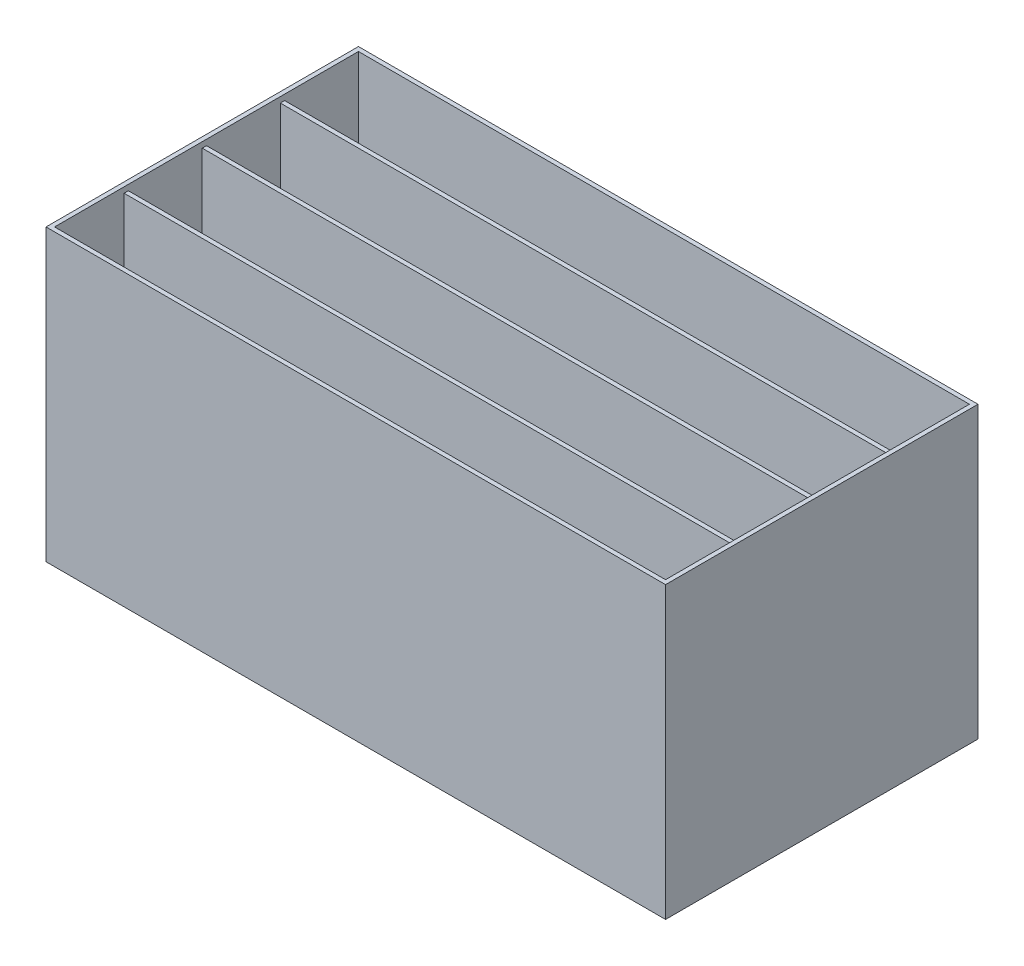
ISO-10303-21;
HEADER;
FILE_DESCRIPTION(('STEP AP214'),'2;1');
FILE_NAME('part.step','',(''),(''),'','','');
FILE_SCHEMA(('AUTOMOTIVE_DESIGN { 1 0 10303 214 1 1 1 1 }'));
ENDSEC;
DATA;
#1=APPLICATION_CONTEXT('core data for automotive mechanical design processes');
#2=APPLICATION_PROTOCOL_DEFINITION('international standard','automotive_design',2000,#1);
#3=PRODUCT_CONTEXT('',#1,'mechanical');
#4=PRODUCT('Part','Part','',(#3));
#5=PRODUCT_RELATED_PRODUCT_CATEGORY('part','',(#4));
#6=PRODUCT_DEFINITION_FORMATION('','',#4);
#7=PRODUCT_DEFINITION_CONTEXT('part definition',#1,'design');
#8=PRODUCT_DEFINITION('design','',#6,#7);
#9=PRODUCT_DEFINITION_SHAPE('','',#8);
#10=(LENGTH_UNIT() NAMED_UNIT(*) SI_UNIT(.MILLI.,.METRE.));
#11=(NAMED_UNIT(*) PLANE_ANGLE_UNIT() SI_UNIT($,.RADIAN.));
#12=(NAMED_UNIT(*) SI_UNIT($,.STERADIAN.) SOLID_ANGLE_UNIT());
#13=UNCERTAINTY_MEASURE_WITH_UNIT(LENGTH_MEASURE(1.E-05),#10,'distance_accuracy_value','');
#14=(GEOMETRIC_REPRESENTATION_CONTEXT(3) GLOBAL_UNCERTAINTY_ASSIGNED_CONTEXT((#13)) GLOBAL_UNIT_ASSIGNED_CONTEXT((#10,
#11,#12)) REPRESENTATION_CONTEXT('',''));
#15=CARTESIAN_POINT('',(0.,0.,0.));
#16=DIRECTION('',(0.,0.,1.));
#17=DIRECTION('',(1.,0.,0.));
#18=AXIS2_PLACEMENT_3D('',#15,#16,#17);
#19=CARTESIAN_POINT('',(6.35,430.2125,0.));
#20=DIRECTION('',(1.,0.,0.));
#21=DIRECTION('',(0.,0.,-1.));
#22=AXIS2_PLACEMENT_3D('',#19,#20,#21);
#23=PLANE('',#22);
#24=DIRECTION('',(0.,0.,1.));
#25=VECTOR('',#24,1.);
#26=CARTESIAN_POINT('',(6.35,421.894,-115.8875));
#27=LINE('',#26,#25);
#28=CARTESIAN_POINT('',(6.35,421.894,-115.8875));
#29=VERTEX_POINT('',#28);
#30=CARTESIAN_POINT('',(6.35,421.894,-109.5375));
#31=VERTEX_POINT('',#30);
#32=EDGE_CURVE('E53',#29,#31,#27,.T.);
#33=ORIENTED_EDGE('',*,*,#32,.F.);
#34=DIRECTION('',(0.,-1.,0.));
#35=VECTOR('',#34,1.);
#36=CARTESIAN_POINT('',(6.35,421.894,-115.8875));
#37=LINE('',#36,#35);
#38=CARTESIAN_POINT('',(6.35,6.35,-115.8875));
#39=VERTEX_POINT('',#38);
#40=EDGE_CURVE('E647',#29,#39,#37,.T.);
#41=ORIENTED_EDGE('',*,*,#40,.T.);
#42=DIRECTION('',(0.,0.,1.));
#43=VECTOR('',#42,1.);
#44=CARTESIAN_POINT('',(6.35,6.35,0.));
#45=LINE('',#44,#43);
#46=CARTESIAN_POINT('',(6.35,6.35,-225.425));
#47=VERTEX_POINT('',#46);
#48=EDGE_CURVE('E635',#47,#39,#45,.T.);
#49=ORIENTED_EDGE('',*,*,#48,.F.);
#50=DIRECTION('',(0.,-1.,0.));
#51=VECTOR('',#50,1.);
#52=CARTESIAN_POINT('',(6.35,421.894,-225.425));
#53=LINE('',#52,#51);
#54=CARTESIAN_POINT('',(6.35,421.894,-225.425));
#55=VERTEX_POINT('',#54);
#56=EDGE_CURVE('E202',#55,#47,#53,.T.);
#57=ORIENTED_EDGE('',*,*,#56,.F.);
#58=DIRECTION('',(0.,0.,1.));
#59=VECTOR('',#58,1.);
#60=CARTESIAN_POINT('',(6.35,421.894,-231.775));
#61=LINE('',#60,#59);
#62=CARTESIAN_POINT('',(6.35,421.894,-231.775));
#63=VERTEX_POINT('',#62);
#64=EDGE_CURVE('E223',#63,#55,#61,.T.);
#65=ORIENTED_EDGE('',*,*,#64,.F.);
#66=DIRECTION('',(0.,-1.,0.));
#67=VECTOR('',#66,1.);
#68=CARTESIAN_POINT('',(6.35,421.894,-231.775));
#69=LINE('',#68,#67);
#70=CARTESIAN_POINT('',(6.35,6.35,-231.775));
#71=VERTEX_POINT('',#70);
#72=EDGE_CURVE('E199',#63,#71,#69,.T.);
#73=ORIENTED_EDGE('',*,*,#72,.T.);
#74=CARTESIAN_POINT('',(6.35,6.35,-341.3125));
#75=VERTEX_POINT('',#74);
#76=EDGE_CURVE('E268',#75,#71,#45,.T.);
#77=ORIENTED_EDGE('',*,*,#76,.F.);
#78=DIRECTION('',(0.,-1.,0.));
#79=VECTOR('',#78,1.);
#80=CARTESIAN_POINT('',(6.35,421.894,-341.3125));
#81=LINE('',#80,#79);
#82=CARTESIAN_POINT('',(6.35,421.894,-341.3125));
#83=VERTEX_POINT('',#82);
#84=EDGE_CURVE('E262',#83,#75,#81,.T.);
#85=ORIENTED_EDGE('',*,*,#84,.F.);
#86=DIRECTION('',(0.,0.,1.));
#87=VECTOR('',#86,1.);
#88=CARTESIAN_POINT('',(6.35,421.894,-347.6625));
#89=LINE('',#88,#87);
#90=CARTESIAN_POINT('',(6.35,421.894,-347.6625));
#91=VERTEX_POINT('',#90);
#92=EDGE_CURVE('E241',#91,#83,#89,.T.);
#93=ORIENTED_EDGE('',*,*,#92,.F.);
#94=DIRECTION('',(0.,-1.,0.));
#95=VECTOR('',#94,1.);
#96=CARTESIAN_POINT('',(6.35,421.894,-347.6625));
#97=LINE('',#96,#95);
#98=CARTESIAN_POINT('',(6.35,6.35,-347.6625));
#99=VERTEX_POINT('',#98);
#100=EDGE_CURVE('E253',#91,#99,#97,.T.);
#101=ORIENTED_EDGE('',*,*,#100,.T.);
#102=CARTESIAN_POINT('',(6.35,6.35,-457.2));
#103=VERTEX_POINT('',#102);
#104=EDGE_CURVE('E266',#103,#99,#45,.T.);
#105=ORIENTED_EDGE('',*,*,#104,.F.);
#106=DIRECTION('',(0.,-1.,0.));
#107=VECTOR('',#106,1.);
#108=CARTESIAN_POINT('',(6.35,430.2125,-457.2));
#109=LINE('',#108,#107);
#110=CARTESIAN_POINT('',(6.35,430.2125,-457.2));
#111=VERTEX_POINT('',#110);
#112=EDGE_CURVE('E274',#111,#103,#109,.T.);
#113=ORIENTED_EDGE('',*,*,#112,.F.);
#114=DIRECTION('',(0.,0.,1.));
#115=VECTOR('',#114,1.);
#116=CARTESIAN_POINT('',(6.35,430.2125,0.));
#117=LINE('',#116,#115);
#118=CARTESIAN_POINT('',(6.35,430.2125,-6.35));
#119=VERTEX_POINT('',#118);
#120=EDGE_CURVE('E284',#111,#119,#117,.T.);
#121=ORIENTED_EDGE('',*,*,#120,.T.);
#122=DIRECTION('',(0.,-1.,0.));
#123=VECTOR('',#122,1.);
#124=CARTESIAN_POINT('',(6.35,430.2125,-6.35));
#125=LINE('',#124,#123);
#126=CARTESIAN_POINT('',(6.35,6.35,-6.35));
#127=VERTEX_POINT('',#126);
#128=EDGE_CURVE('E269',#119,#127,#125,.T.);
#129=ORIENTED_EDGE('',*,*,#128,.T.);
#130=CARTESIAN_POINT('',(6.35,6.35,-109.5375));
#131=VERTEX_POINT('',#130);
#132=EDGE_CURVE('E265',#131,#127,#45,.T.);
#133=ORIENTED_EDGE('',*,*,#132,.F.);
#134=DIRECTION('',(0.,-1.,0.));
#135=VECTOR('',#134,1.);
#136=CARTESIAN_POINT('',(6.35,421.894,-109.5375));
#137=LINE('',#136,#135);
#138=EDGE_CURVE('E58',#31,#131,#137,.T.);
#139=ORIENTED_EDGE('',*,*,#138,.F.);
#140=EDGE_LOOP('',(#33,#41,#49,#57,#65,#73,#77,#85,#93,#101,#105,#113,#121,#129,#133,#139));
#141=FACE_BOUND('',#140,.T.);
#142=ADVANCED_FACE('F38',(#141),#23,.T.);
#143=CARTESIAN_POINT('',(912.8125,430.2125,0.));
#144=DIRECTION('',(-1.,0.,0.));
#145=DIRECTION('',(0.,0.,1.));
#146=AXIS2_PLACEMENT_3D('',#143,#144,#145);
#147=PLANE('',#146);
#148=DIRECTION('',(0.,0.,-1.));
#149=VECTOR('',#148,1.);
#150=CARTESIAN_POINT('',(912.8125,6.35,0.));
#151=LINE('',#150,#149);
#152=CARTESIAN_POINT('',(912.8125,6.35,-115.8875));
#153=VERTEX_POINT('',#152);
#154=CARTESIAN_POINT('',(912.8125,6.35,-225.425));
#155=VERTEX_POINT('',#154);
#156=EDGE_CURVE('E184',#153,#155,#151,.T.);
#157=ORIENTED_EDGE('',*,*,#156,.F.);
#158=DIRECTION('',(0.,-1.,0.));
#159=VECTOR('',#158,1.);
#160=CARTESIAN_POINT('',(912.8125,421.894,-115.8875));
#161=LINE('',#160,#159);
#162=CARTESIAN_POINT('',(912.8125,421.894,-115.8875));
#163=VERTEX_POINT('',#162);
#164=EDGE_CURVE('E196',#163,#153,#161,.T.);
#165=ORIENTED_EDGE('',*,*,#164,.F.);
#166=DIRECTION('',(0.,0.,-1.));
#167=VECTOR('',#166,1.);
#168=CARTESIAN_POINT('',(912.8125,421.894,-115.8875));
#169=LINE('',#168,#167);
#170=CARTESIAN_POINT('',(912.8125,421.894,-109.5375));
#171=VERTEX_POINT('',#170);
#172=EDGE_CURVE('E192',#171,#163,#169,.T.);
#173=ORIENTED_EDGE('',*,*,#172,.F.);
#174=DIRECTION('',(0.,-1.,0.));
#175=VECTOR('',#174,1.);
#176=CARTESIAN_POINT('',(912.8125,421.894,-109.5375));
#177=LINE('',#176,#175);
#178=CARTESIAN_POINT('',(912.8125,6.35,-109.5375));
#179=VERTEX_POINT('',#178);
#180=EDGE_CURVE('E188',#171,#179,#177,.T.);
#181=ORIENTED_EDGE('',*,*,#180,.T.);
#182=CARTESIAN_POINT('',(912.8125,6.35,-6.35));
#183=VERTEX_POINT('',#182);
#184=EDGE_CURVE('E173',#183,#179,#151,.T.);
#185=ORIENTED_EDGE('',*,*,#184,.F.);
#186=DIRECTION('',(0.,-1.,0.));
#187=VECTOR('',#186,1.);
#188=CARTESIAN_POINT('',(912.8125,430.2125,-6.35));
#189=LINE('',#188,#187);
#190=CARTESIAN_POINT('',(912.8125,430.2125,-6.35));
#191=VERTEX_POINT('',#190);
#192=EDGE_CURVE('E273',#191,#183,#189,.T.);
#193=ORIENTED_EDGE('',*,*,#192,.F.);
#194=DIRECTION('',(0.,0.,-1.));
#195=VECTOR('',#194,1.);
#196=CARTESIAN_POINT('',(912.8125,430.2125,0.));
#197=LINE('',#196,#195);
#198=CARTESIAN_POINT('',(912.8125,430.2125,-457.2));
#199=VERTEX_POINT('',#198);
#200=EDGE_CURVE('E288',#191,#199,#197,.T.);
#201=ORIENTED_EDGE('',*,*,#200,.T.);
#202=DIRECTION('',(0.,-1.,0.));
#203=VECTOR('',#202,1.);
#204=CARTESIAN_POINT('',(912.8125,430.2125,-457.2));
#205=LINE('',#204,#203);
#206=CARTESIAN_POINT('',(912.8125,6.35,-457.2));
#207=VERTEX_POINT('',#206);
#208=EDGE_CURVE('E277',#199,#207,#205,.T.);
#209=ORIENTED_EDGE('',*,*,#208,.T.);
#210=CARTESIAN_POINT('',(912.8125,6.35,-347.6625));
#211=VERTEX_POINT('',#210);
#212=EDGE_CURVE('E186',#211,#207,#151,.T.);
#213=ORIENTED_EDGE('',*,*,#212,.F.);
#214=DIRECTION('',(0.,-1.,0.));
#215=VECTOR('',#214,1.);
#216=CARTESIAN_POINT('',(912.8125,421.894,-347.6625));
#217=LINE('',#216,#215);
#218=CARTESIAN_POINT('',(912.8125,421.894,-347.6625));
#219=VERTEX_POINT('',#218);
#220=EDGE_CURVE('E256',#219,#211,#217,.T.);
#221=ORIENTED_EDGE('',*,*,#220,.F.);
#222=DIRECTION('',(0.,0.,-1.));
#223=VECTOR('',#222,1.);
#224=CARTESIAN_POINT('',(912.8125,421.894,-347.6625));
#225=LINE('',#224,#223);
#226=CARTESIAN_POINT('',(912.8125,421.894,-341.3125));
#227=VERTEX_POINT('',#226);
#228=EDGE_CURVE('E247',#227,#219,#225,.T.);
#229=ORIENTED_EDGE('',*,*,#228,.F.);
#230=DIRECTION('',(0.,-1.,0.));
#231=VECTOR('',#230,1.);
#232=CARTESIAN_POINT('',(912.8125,421.894,-341.3125));
#233=LINE('',#232,#231);
#234=CARTESIAN_POINT('',(912.8125,6.35,-341.3125));
#235=VERTEX_POINT('',#234);
#236=EDGE_CURVE('E259',#227,#235,#233,.T.);
#237=ORIENTED_EDGE('',*,*,#236,.T.);
#238=CARTESIAN_POINT('',(912.8125,6.35,-231.775));
#239=VERTEX_POINT('',#238);
#240=EDGE_CURVE('E639',#239,#235,#151,.T.);
#241=ORIENTED_EDGE('',*,*,#240,.F.);
#242=DIRECTION('',(0.,-1.,0.));
#243=VECTOR('',#242,1.);
#244=CARTESIAN_POINT('',(912.8125,421.894,-231.775));
#245=LINE('',#244,#243);
#246=CARTESIAN_POINT('',(912.8125,421.894,-231.775));
#247=VERTEX_POINT('',#246);
#248=EDGE_CURVE('E214',#247,#239,#245,.T.);
#249=ORIENTED_EDGE('',*,*,#248,.F.);
#250=DIRECTION('',(0.,0.,-1.));
#251=VECTOR('',#250,1.);
#252=CARTESIAN_POINT('',(912.8125,421.894,-231.775));
#253=LINE('',#252,#251);
#254=CARTESIAN_POINT('',(912.8125,421.894,-225.425));
#255=VERTEX_POINT('',#254);
#256=EDGE_CURVE('E217',#255,#247,#253,.T.);
#257=ORIENTED_EDGE('',*,*,#256,.F.);
#258=DIRECTION('',(0.,-1.,0.));
#259=VECTOR('',#258,1.);
#260=CARTESIAN_POINT('',(912.8125,421.894,-225.425));
#261=LINE('',#260,#259);
#262=EDGE_CURVE('E211',#255,#155,#261,.T.);
#263=ORIENTED_EDGE('',*,*,#262,.T.);
#264=EDGE_LOOP('',(#157,#165,#173,#181,#185,#193,#201,#209,#213,#221,#229,#237,#241,#249,#257,#263));
#265=FACE_BOUND('',#264,.T.);
#266=ADVANCED_FACE('F190',(#265),#147,.T.);
#267=CARTESIAN_POINT('',(0.,6.35,0.));
#268=DIRECTION('',(0.,-1.,0.));
#269=DIRECTION('',(0.,0.,-1.));
#270=AXIS2_PLACEMENT_3D('',#267,#268,#269);
#271=PLANE('',#270);
#272=DIRECTION('',(-1.,0.,0.));
#273=VECTOR('',#272,1.);
#274=CARTESIAN_POINT('',(6.35,6.35,-115.8875));
#275=LINE('',#274,#273);
#276=EDGE_CURVE('E200',#153,#39,#275,.T.);
#277=ORIENTED_EDGE('',*,*,#276,.F.);
#278=ORIENTED_EDGE('',*,*,#156,.T.);
#279=DIRECTION('',(1.,0.,0.));
#280=VECTOR('',#279,1.);
#281=CARTESIAN_POINT('',(6.35,6.35,-225.425));
#282=LINE('',#281,#280);
#283=EDGE_CURVE('E232',#47,#155,#282,.T.);
#284=ORIENTED_EDGE('',*,*,#283,.F.);
#285=ORIENTED_EDGE('',*,*,#48,.T.);
#286=EDGE_LOOP('',(#277,#278,#284,#285));
#287=FACE_BOUND('',#286,.T.);
#288=ADVANCED_FACE('F348',(#287),#271,.F.);
#289=DIRECTION('',(1.,0.,0.));
#290=VECTOR('',#289,1.);
#291=CARTESIAN_POINT('',(6.35,6.35,-109.5375));
#292=LINE('',#291,#290);
#293=EDGE_CURVE('E177',#131,#179,#292,.T.);
#294=ORIENTED_EDGE('',*,*,#293,.F.);
#295=ORIENTED_EDGE('',*,*,#132,.T.);
#296=DIRECTION('',(1.,0.,0.));
#297=VECTOR('',#296,1.);
#298=CARTESIAN_POINT('',(0.,6.35,-6.35));
#299=LINE('',#298,#297);
#300=EDGE_CURVE('E179',#127,#183,#299,.T.);
#301=ORIENTED_EDGE('',*,*,#300,.T.);
#302=ORIENTED_EDGE('',*,*,#184,.T.);
#303=EDGE_LOOP('',(#294,#295,#301,#302));
#304=FACE_BOUND('',#303,.T.);
#305=ADVANCED_FACE('F175',(#304),#271,.F.);
#306=DIRECTION('',(-1.,0.,0.));
#307=VECTOR('',#306,1.);
#308=CARTESIAN_POINT('',(6.35,6.35,-231.775));
#309=LINE('',#308,#307);
#310=EDGE_CURVE('E229',#239,#71,#309,.T.);
#311=ORIENTED_EDGE('',*,*,#310,.F.);
#312=ORIENTED_EDGE('',*,*,#240,.T.);
#313=DIRECTION('',(1.,0.,0.));
#314=VECTOR('',#313,1.);
#315=CARTESIAN_POINT('',(6.35,6.35,-341.3125));
#316=LINE('',#315,#314);
#317=EDGE_CURVE('E238',#75,#235,#316,.T.);
#318=ORIENTED_EDGE('',*,*,#317,.F.);
#319=ORIENTED_EDGE('',*,*,#76,.T.);
#320=EDGE_LOOP('',(#311,#312,#318,#319));
#321=FACE_BOUND('',#320,.T.);
#322=ADVANCED_FACE('F362',(#321),#271,.F.);
#323=DIRECTION('',(-1.,0.,0.));
#324=VECTOR('',#323,1.);
#325=CARTESIAN_POINT('',(6.35,6.35,-347.6625));
#326=LINE('',#325,#324);
#327=EDGE_CURVE('E235',#211,#99,#326,.T.);
#328=ORIENTED_EDGE('',*,*,#327,.F.);
#329=ORIENTED_EDGE('',*,*,#212,.T.);
#330=DIRECTION('',(-1.,0.,0.));
#331=VECTOR('',#330,1.);
#332=CARTESIAN_POINT('',(0.,6.35,-457.2));
#333=LINE('',#332,#331);
#334=EDGE_CURVE('E183',#207,#103,#333,.T.);
#335=ORIENTED_EDGE('',*,*,#334,.T.);
#336=ORIENTED_EDGE('',*,*,#104,.T.);
#337=EDGE_LOOP('',(#328,#329,#335,#336));
#338=FACE_BOUND('',#337,.T.);
#339=ADVANCED_FACE('F365',(#338),#271,.F.);
#340=CARTESIAN_POINT('',(0.,430.2125,0.));
#341=DIRECTION('',(0.,-1.,0.));
#342=DIRECTION('',(0.,0.,-1.));
#343=AXIS2_PLACEMENT_3D('',#340,#341,#342);
#344=PLANE('',#343);
#345=DIRECTION('',(0.,0.,1.));
#346=VECTOR('',#345,1.);
#347=CARTESIAN_POINT('',(0.,430.2125,0.));
#348=LINE('',#347,#346);
#349=CARTESIAN_POINT('',(0.,430.2125,-463.55));
#350=VERTEX_POINT('',#349);
#351=CARTESIAN_POINT('',(0.,430.2125,0.));
#352=VERTEX_POINT('',#351);
#353=EDGE_CURVE('E292',#350,#352,#348,.T.);
#354=ORIENTED_EDGE('',*,*,#353,.T.);
#355=DIRECTION('',(1.,0.,0.));
#356=VECTOR('',#355,1.);
#357=CARTESIAN_POINT('',(0.,430.2125,0.));
#358=LINE('',#357,#356);
#359=CARTESIAN_POINT('',(919.1625,430.2125,0.));
#360=VERTEX_POINT('',#359);
#361=EDGE_CURVE('E295',#352,#360,#358,.T.);
#362=ORIENTED_EDGE('',*,*,#361,.T.);
#363=DIRECTION('',(0.,0.,-1.));
#364=VECTOR('',#363,1.);
#365=CARTESIAN_POINT('',(919.1625,430.2125,0.));
#366=LINE('',#365,#364);
#367=CARTESIAN_POINT('',(919.1625,430.2125,-463.55));
#368=VERTEX_POINT('',#367);
#369=EDGE_CURVE('E298',#360,#368,#366,.T.);
#370=ORIENTED_EDGE('',*,*,#369,.T.);
#371=DIRECTION('',(-1.,0.,0.));
#372=VECTOR('',#371,1.);
#373=CARTESIAN_POINT('',(0.,430.2125,-463.55));
#374=LINE('',#373,#372);
#375=EDGE_CURVE('E300',#368,#350,#374,.T.);
#376=ORIENTED_EDGE('',*,*,#375,.T.);
#377=EDGE_LOOP('',(#354,#362,#370,#376));
#378=FACE_BOUND('',#377,.T.);
#379=ORIENTED_EDGE('',*,*,#120,.F.);
#380=DIRECTION('',(-1.,0.,0.));
#381=VECTOR('',#380,1.);
#382=CARTESIAN_POINT('',(0.,430.2125,-457.2));
#383=LINE('',#382,#381);
#384=EDGE_CURVE('E278',#199,#111,#383,.T.);
#385=ORIENTED_EDGE('',*,*,#384,.F.);
#386=ORIENTED_EDGE('',*,*,#200,.F.);
#387=DIRECTION('',(1.,0.,0.));
#388=VECTOR('',#387,1.);
#389=CARTESIAN_POINT('',(0.,430.2125,-6.35));
#390=LINE('',#389,#388);
#391=EDGE_CURVE('E286',#119,#191,#390,.T.);
#392=ORIENTED_EDGE('',*,*,#391,.F.);
#393=EDGE_LOOP('',(#379,#385,#386,#392));
#394=FACE_BOUND('',#393,.T.);
#395=ADVANCED_FACE('F334',(#378,#394),#344,.F.);
#396=CARTESIAN_POINT('',(0.,430.2125,0.));
#397=DIRECTION('',(1.,0.,0.));
#398=DIRECTION('',(0.,0.,-1.));
#399=AXIS2_PLACEMENT_3D('',#396,#397,#398);
#400=PLANE('',#399);
#401=DIRECTION('',(0.,0.,1.));
#402=VECTOR('',#401,1.);
#403=CARTESIAN_POINT('',(0.,0.,0.));
#404=LINE('',#403,#402);
#405=CARTESIAN_POINT('',(0.,0.,-463.55));
#406=VERTEX_POINT('',#405);
#407=CARTESIAN_POINT('',(0.,0.,0.));
#408=VERTEX_POINT('',#407);
#409=EDGE_CURVE('E272',#406,#408,#404,.T.);
#410=ORIENTED_EDGE('',*,*,#409,.T.);
#411=DIRECTION('',(0.,-1.,0.));
#412=VECTOR('',#411,1.);
#413=CARTESIAN_POINT('',(0.,430.2125,0.));
#414=LINE('',#413,#412);
#415=EDGE_CURVE('E11',#352,#408,#414,.T.);
#416=ORIENTED_EDGE('',*,*,#415,.F.);
#417=ORIENTED_EDGE('',*,*,#353,.F.);
#418=DIRECTION('',(0.,-1.,0.));
#419=VECTOR('',#418,1.);
#420=CARTESIAN_POINT('',(0.,430.2125,-463.55));
#421=LINE('',#420,#419);
#422=EDGE_CURVE('E302',#350,#406,#421,.T.);
#423=ORIENTED_EDGE('',*,*,#422,.T.);
#424=EDGE_LOOP('',(#410,#416,#417,#423));
#425=FACE_BOUND('',#424,.T.);
#426=ADVANCED_FACE('F40',(#425),#400,.F.);
#427=CARTESIAN_POINT('',(0.,430.2125,0.));
#428=DIRECTION('',(0.,0.,-1.));
#429=DIRECTION('',(-1.,0.,0.));
#430=AXIS2_PLACEMENT_3D('',#427,#428,#429);
#431=PLANE('',#430);
#432=DIRECTION('',(1.,0.,0.));
#433=VECTOR('',#432,1.);
#434=CARTESIAN_POINT('',(0.,0.,0.));
#435=LINE('',#434,#433);
#436=CARTESIAN_POINT('',(919.1625,0.,0.));
#437=VERTEX_POINT('',#436);
#438=EDGE_CURVE('E305',#408,#437,#435,.T.);
#439=ORIENTED_EDGE('',*,*,#438,.T.);
#440=DIRECTION('',(0.,-1.,0.));
#441=VECTOR('',#440,1.);
#442=CARTESIAN_POINT('',(919.1625,430.2125,0.));
#443=LINE('',#442,#441);
#444=EDGE_CURVE('E46',#360,#437,#443,.T.);
#445=ORIENTED_EDGE('',*,*,#444,.F.);
#446=ORIENTED_EDGE('',*,*,#361,.F.);
#447=ORIENTED_EDGE('',*,*,#415,.T.);
#448=EDGE_LOOP('',(#439,#445,#446,#447));
#449=FACE_BOUND('',#448,.T.);
#450=ADVANCED_FACE('F336',(#449),#431,.F.);
#451=CARTESIAN_POINT('',(919.1625,430.2125,0.));
#452=DIRECTION('',(-1.,0.,0.));
#453=DIRECTION('',(0.,0.,1.));
#454=AXIS2_PLACEMENT_3D('',#451,#452,#453);
#455=PLANE('',#454);
#456=DIRECTION('',(0.,0.,-1.));
#457=VECTOR('',#456,1.);
#458=CARTESIAN_POINT('',(919.1625,0.,0.));
#459=LINE('',#458,#457);
#460=CARTESIAN_POINT('',(919.1625,0.,-463.55));
#461=VERTEX_POINT('',#460);
#462=EDGE_CURVE('E307',#437,#461,#459,.T.);
#463=ORIENTED_EDGE('',*,*,#462,.T.);
#464=DIRECTION('',(0.,-1.,0.));
#465=VECTOR('',#464,1.);
#466=CARTESIAN_POINT('',(919.1625,430.2125,-463.55));
#467=LINE('',#466,#465);
#468=EDGE_CURVE('E312',#368,#461,#467,.T.);
#469=ORIENTED_EDGE('',*,*,#468,.F.);
#470=ORIENTED_EDGE('',*,*,#369,.F.);
#471=ORIENTED_EDGE('',*,*,#444,.T.);
#472=EDGE_LOOP('',(#463,#469,#470,#471));
#473=FACE_BOUND('',#472,.T.);
#474=ADVANCED_FACE('F319',(#473),#455,.F.);
#475=CARTESIAN_POINT('',(0.,430.2125,-463.55));
#476=DIRECTION('',(0.,0.,1.));
#477=DIRECTION('',(1.,0.,0.));
#478=AXIS2_PLACEMENT_3D('',#475,#476,#477);
#479=PLANE('',#478);
#480=DIRECTION('',(-1.,0.,0.));
#481=VECTOR('',#480,1.);
#482=CARTESIAN_POINT('',(0.,0.,-463.55));
#483=LINE('',#482,#481);
#484=EDGE_CURVE('E296',#461,#406,#483,.T.);
#485=ORIENTED_EDGE('',*,*,#484,.T.);
#486=ORIENTED_EDGE('',*,*,#422,.F.);
#487=ORIENTED_EDGE('',*,*,#375,.F.);
#488=ORIENTED_EDGE('',*,*,#468,.T.);
#489=EDGE_LOOP('',(#485,#486,#487,#488));
#490=FACE_BOUND('',#489,.T.);
#491=ADVANCED_FACE('F328',(#490),#479,.F.);
#492=CARTESIAN_POINT('',(0.,0.,0.));
#493=DIRECTION('',(0.,-1.,0.));
#494=DIRECTION('',(0.,0.,-1.));
#495=AXIS2_PLACEMENT_3D('',#492,#493,#494);
#496=PLANE('',#495);
#497=ORIENTED_EDGE('',*,*,#409,.F.);
#498=ORIENTED_EDGE('',*,*,#484,.F.);
#499=ORIENTED_EDGE('',*,*,#462,.F.);
#500=ORIENTED_EDGE('',*,*,#438,.F.);
#501=EDGE_LOOP('',(#497,#498,#499,#500));
#502=FACE_BOUND('',#501,.T.);
#503=ADVANCED_FACE('F325',(#502),#496,.T.);
#504=CARTESIAN_POINT('',(0.,430.2125,-6.35));
#505=DIRECTION('',(0.,0.,-1.));
#506=DIRECTION('',(-1.,0.,0.));
#507=AXIS2_PLACEMENT_3D('',#504,#505,#506);
#508=PLANE('',#507);
#509=ORIENTED_EDGE('',*,*,#300,.F.);
#510=ORIENTED_EDGE('',*,*,#128,.F.);
#511=ORIENTED_EDGE('',*,*,#391,.T.);
#512=ORIENTED_EDGE('',*,*,#192,.T.);
#513=EDGE_LOOP('',(#509,#510,#511,#512));
#514=FACE_BOUND('',#513,.T.);
#515=ADVANCED_FACE('F354',(#514),#508,.T.);
#516=CARTESIAN_POINT('',(0.,430.2125,-457.2));
#517=DIRECTION('',(0.,0.,1.));
#518=DIRECTION('',(1.,0.,0.));
#519=AXIS2_PLACEMENT_3D('',#516,#517,#518);
#520=PLANE('',#519);
#521=ORIENTED_EDGE('',*,*,#334,.F.);
#522=ORIENTED_EDGE('',*,*,#208,.F.);
#523=ORIENTED_EDGE('',*,*,#384,.T.);
#524=ORIENTED_EDGE('',*,*,#112,.T.);
#525=EDGE_LOOP('',(#521,#522,#523,#524));
#526=FACE_BOUND('',#525,.T.);
#527=ADVANCED_FACE('F356',(#526),#520,.T.);
#528=CARTESIAN_POINT('',(6.35,421.894,-341.3125));
#529=DIRECTION('',(0.,0.,-1.));
#530=DIRECTION('',(-1.,0.,0.));
#531=AXIS2_PLACEMENT_3D('',#528,#529,#530);
#532=PLANE('',#531);
#533=ORIENTED_EDGE('',*,*,#84,.T.);
#534=ORIENTED_EDGE('',*,*,#317,.T.);
#535=ORIENTED_EDGE('',*,*,#236,.F.);
#536=DIRECTION('',(1.,0.,0.));
#537=VECTOR('',#536,1.);
#538=CARTESIAN_POINT('',(6.35,421.894,-341.3125));
#539=LINE('',#538,#537);
#540=EDGE_CURVE('E244',#83,#227,#539,.T.);
#541=ORIENTED_EDGE('',*,*,#540,.F.);
#542=EDGE_LOOP('',(#533,#534,#535,#541));
#543=FACE_BOUND('',#542,.T.);
#544=ADVANCED_FACE('F352',(#543),#532,.F.);
#545=CARTESIAN_POINT('',(6.35,421.894,-347.6625));
#546=DIRECTION('',(0.,0.,1.));
#547=DIRECTION('',(1.,0.,0.));
#548=AXIS2_PLACEMENT_3D('',#545,#546,#547);
#549=PLANE('',#548);
#550=ORIENTED_EDGE('',*,*,#220,.T.);
#551=ORIENTED_EDGE('',*,*,#327,.T.);
#552=ORIENTED_EDGE('',*,*,#100,.F.);
#553=DIRECTION('',(-1.,0.,0.));
#554=VECTOR('',#553,1.);
#555=CARTESIAN_POINT('',(6.35,421.894,-347.6625));
#556=LINE('',#555,#554);
#557=EDGE_CURVE('E250',#219,#91,#556,.T.);
#558=ORIENTED_EDGE('',*,*,#557,.F.);
#559=EDGE_LOOP('',(#550,#551,#552,#558));
#560=FACE_BOUND('',#559,.T.);
#561=ADVANCED_FACE('F394',(#560),#549,.F.);
#562=CARTESIAN_POINT('',(0.,421.894,0.));
#563=DIRECTION('',(0.,1.,0.));
#564=DIRECTION('',(0.,0.,1.));
#565=AXIS2_PLACEMENT_3D('',#562,#563,#564);
#566=PLANE('',#565);
#567=ORIENTED_EDGE('',*,*,#92,.T.);
#568=ORIENTED_EDGE('',*,*,#540,.T.);
#569=ORIENTED_EDGE('',*,*,#228,.T.);
#570=ORIENTED_EDGE('',*,*,#557,.T.);
#571=EDGE_LOOP('',(#567,#568,#569,#570));
#572=FACE_BOUND('',#571,.T.);
#573=ADVANCED_FACE('F401',(#572),#566,.T.);
#574=CARTESIAN_POINT('',(6.35,421.894,-231.775));
#575=DIRECTION('',(0.,0.,1.));
#576=DIRECTION('',(1.,0.,0.));
#577=AXIS2_PLACEMENT_3D('',#574,#575,#576);
#578=PLANE('',#577);
#579=ORIENTED_EDGE('',*,*,#248,.T.);
#580=ORIENTED_EDGE('',*,*,#310,.T.);
#581=ORIENTED_EDGE('',*,*,#72,.F.);
#582=DIRECTION('',(-1.,0.,0.));
#583=VECTOR('',#582,1.);
#584=CARTESIAN_POINT('',(6.35,421.894,-231.775));
#585=LINE('',#584,#583);
#586=EDGE_CURVE('E226',#247,#63,#585,.T.);
#587=ORIENTED_EDGE('',*,*,#586,.F.);
#588=EDGE_LOOP('',(#579,#580,#581,#587));
#589=FACE_BOUND('',#588,.T.);
#590=ADVANCED_FACE('F408',(#589),#578,.F.);
#591=CARTESIAN_POINT('',(6.35,421.894,-225.425));
#592=DIRECTION('',(0.,0.,-1.));
#593=DIRECTION('',(-1.,0.,0.));
#594=AXIS2_PLACEMENT_3D('',#591,#592,#593);
#595=PLANE('',#594);
#596=ORIENTED_EDGE('',*,*,#56,.T.);
#597=ORIENTED_EDGE('',*,*,#283,.T.);
#598=ORIENTED_EDGE('',*,*,#262,.F.);
#599=DIRECTION('',(1.,0.,0.));
#600=VECTOR('',#599,1.);
#601=CARTESIAN_POINT('',(6.35,421.894,-225.425));
#602=LINE('',#601,#600);
#603=EDGE_CURVE('E220',#55,#255,#602,.T.);
#604=ORIENTED_EDGE('',*,*,#603,.F.);
#605=EDGE_LOOP('',(#596,#597,#598,#604));
#606=FACE_BOUND('',#605,.T.);
#607=ADVANCED_FACE('F416',(#606),#595,.F.);
#608=CARTESIAN_POINT('',(0.,421.894,0.));
#609=DIRECTION('',(0.,-1.,0.));
#610=DIRECTION('',(0.,0.,-1.));
#611=AXIS2_PLACEMENT_3D('',#608,#609,#610);
#612=PLANE('',#611);
#613=ORIENTED_EDGE('',*,*,#586,.T.);
#614=ORIENTED_EDGE('',*,*,#64,.T.);
#615=ORIENTED_EDGE('',*,*,#603,.T.);
#616=ORIENTED_EDGE('',*,*,#256,.T.);
#617=EDGE_LOOP('',(#613,#614,#615,#616));
#618=FACE_BOUND('',#617,.T.);
#619=ADVANCED_FACE('F424',(#618),#612,.F.);
#620=CARTESIAN_POINT('',(6.35,421.894,-115.8875));
#621=DIRECTION('',(0.,0.,1.));
#622=DIRECTION('',(1.,0.,0.));
#623=AXIS2_PLACEMENT_3D('',#620,#621,#622);
#624=PLANE('',#623);
#625=ORIENTED_EDGE('',*,*,#164,.T.);
#626=ORIENTED_EDGE('',*,*,#276,.T.);
#627=ORIENTED_EDGE('',*,*,#40,.F.);
#628=DIRECTION('',(-1.,0.,0.));
#629=VECTOR('',#628,1.);
#630=CARTESIAN_POINT('',(6.35,421.894,-115.8875));
#631=LINE('',#630,#629);
#632=EDGE_CURVE('E205',#163,#29,#631,.T.);
#633=ORIENTED_EDGE('',*,*,#632,.F.);
#634=EDGE_LOOP('',(#625,#626,#627,#633));
#635=FACE_BOUND('',#634,.T.);
#636=ADVANCED_FACE('F432',(#635),#624,.F.);
#637=CARTESIAN_POINT('',(6.35,421.894,-109.5375));
#638=DIRECTION('',(0.,0.,-1.));
#639=DIRECTION('',(-1.,0.,0.));
#640=AXIS2_PLACEMENT_3D('',#637,#638,#639);
#641=PLANE('',#640);
#642=ORIENTED_EDGE('',*,*,#138,.T.);
#643=ORIENTED_EDGE('',*,*,#293,.T.);
#644=ORIENTED_EDGE('',*,*,#180,.F.);
#645=DIRECTION('',(1.,0.,0.));
#646=VECTOR('',#645,1.);
#647=CARTESIAN_POINT('',(6.35,421.894,-109.5375));
#648=LINE('',#647,#646);
#649=EDGE_CURVE('E642',#31,#171,#648,.T.);
#650=ORIENTED_EDGE('',*,*,#649,.F.);
#651=EDGE_LOOP('',(#642,#643,#644,#650));
#652=FACE_BOUND('',#651,.T.);
#653=ADVANCED_FACE('F198',(#652),#641,.F.);
#654=CARTESIAN_POINT('',(0.,421.894,0.));
#655=DIRECTION('',(0.,-1.,0.));
#656=DIRECTION('',(0.,0.,-1.));
#657=AXIS2_PLACEMENT_3D('',#654,#655,#656);
#658=PLANE('',#657);
#659=ORIENTED_EDGE('',*,*,#632,.T.);
#660=ORIENTED_EDGE('',*,*,#32,.T.);
#661=ORIENTED_EDGE('',*,*,#649,.T.);
#662=ORIENTED_EDGE('',*,*,#172,.T.);
#663=EDGE_LOOP('',(#659,#660,#661,#662));
#664=FACE_BOUND('',#663,.T.);
#665=ADVANCED_FACE('F447',(#664),#658,.F.);
#666=CLOSED_SHELL('',(#142,#266,#288,#305,#322,#339,#395,#426,#450,#474,#491,#503,#515,#527,
#544,#561,#573,#590,#607,#619,#636,#653,#665));
#667=MANIFOLD_SOLID_BREP('B2',#666);
#668=ADVANCED_BREP_SHAPE_REPRESENTATION('',(#18,#667),#14);
#669=SHAPE_DEFINITION_REPRESENTATION(#9,#668);
ENDSEC;
END-ISO-10303-21;
